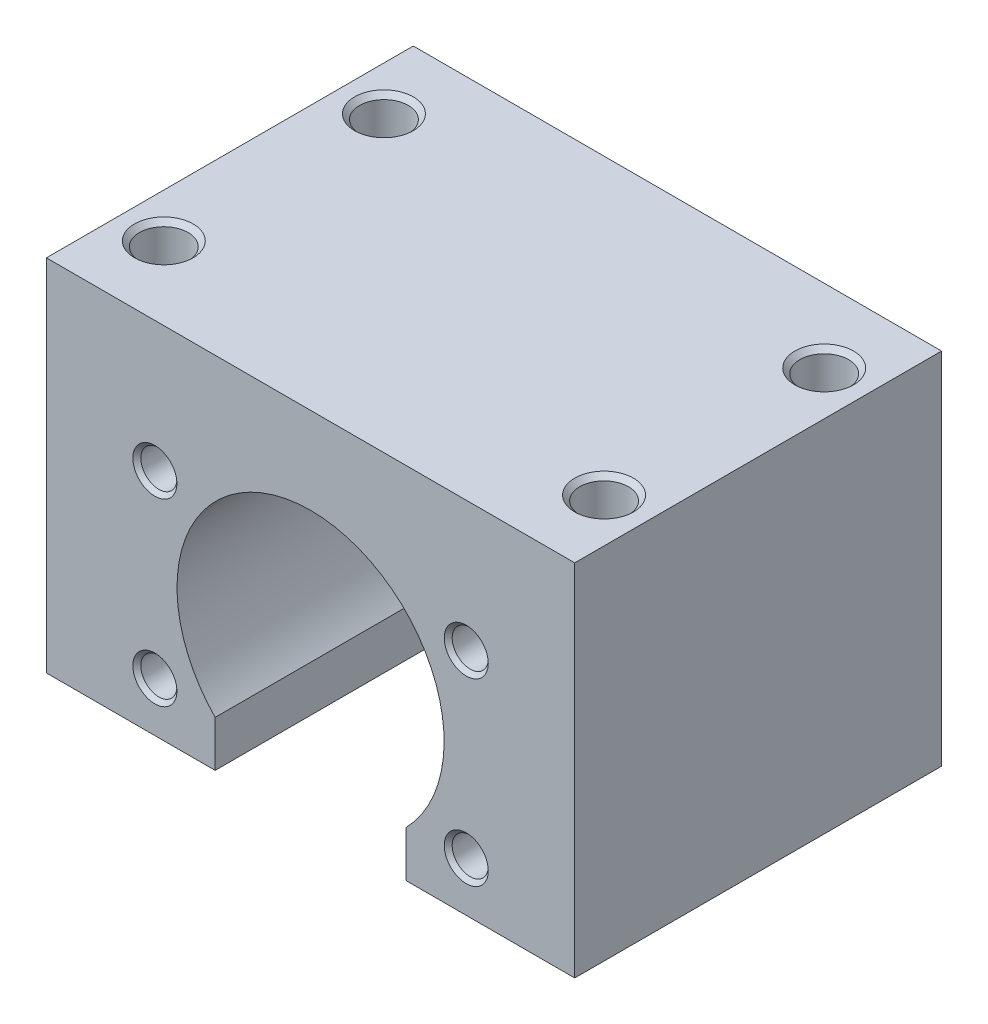
ISO-10303-21;
HEADER;
FILE_DESCRIPTION(('STEP AP214'),'2;1');
FILE_NAME('part.step','',(''),(''),'','','');
FILE_SCHEMA(('AUTOMOTIVE_DESIGN { 1 0 10303 214 1 1 1 1 }'));
ENDSEC;
DATA;
#1=APPLICATION_CONTEXT('core data for automotive mechanical design processes');
#2=APPLICATION_PROTOCOL_DEFINITION('international standard','automotive_design',2000,#1);
#3=PRODUCT_CONTEXT('',#1,'mechanical');
#4=PRODUCT('Part','Part','',(#3));
#5=PRODUCT_RELATED_PRODUCT_CATEGORY('part','',(#4));
#6=PRODUCT_DEFINITION_FORMATION('','',#4);
#7=PRODUCT_DEFINITION_CONTEXT('part definition',#1,'design');
#8=PRODUCT_DEFINITION('design','',#6,#7);
#9=PRODUCT_DEFINITION_SHAPE('','',#8);
#10=(LENGTH_UNIT() NAMED_UNIT(*) SI_UNIT(.MILLI.,.METRE.));
#11=(NAMED_UNIT(*) PLANE_ANGLE_UNIT() SI_UNIT($,.RADIAN.));
#12=(NAMED_UNIT(*) SI_UNIT($,.STERADIAN.) SOLID_ANGLE_UNIT());
#13=UNCERTAINTY_MEASURE_WITH_UNIT(LENGTH_MEASURE(1.E-05),#10,'distance_accuracy_value','');
#14=(GEOMETRIC_REPRESENTATION_CONTEXT(3) GLOBAL_UNCERTAINTY_ASSIGNED_CONTEXT((#13)) GLOBAL_UNIT_ASSIGNED_CONTEXT((#10,
#11,#12)) REPRESENTATION_CONTEXT('',''));
#15=CARTESIAN_POINT('',(0.,0.,0.));
#16=DIRECTION('',(0.,0.,1.));
#17=DIRECTION('',(1.,0.,0.));
#18=AXIS2_PLACEMENT_3D('',#15,#16,#17);
#19=CARTESIAN_POINT('',(21.2176223927187,12.25,13.0000000000337));
#20=DIRECTION('',(0.,0.,1.));
#21=DIRECTION('',(0.,-1.,0.));
#22=AXIS2_PLACEMENT_3D('',#19,#20,#21);
#23=CONICAL_SURFACE('',#22,2.45850000009703,1.04719755119452);
#24=CARTESIAN_POINT('',(21.2176223927187,12.25,11.5805843631733));
#25=VERTEX_POINT('',#24);
#26=VERTEX_LOOP('',#25);
#27=FACE_BOUND('',#26,.T.);
#28=CARTESIAN_POINT('',(21.2176223927187,12.25,13.));
#29=DIRECTION('',(0.,0.,-1.));
#30=DIRECTION('',(-1.,0.,0.));
#31=AXIS2_PLACEMENT_3D('',#28,#29,#30);
#32=CIRCLE('',#31,2.4585);
#33=CARTESIAN_POINT('',(18.7591223927187,12.25,13.));
#34=VERTEX_POINT('',#33);
#35=EDGE_CURVE('E235',#34,#34,#32,.F.);
#36=ORIENTED_EDGE('',*,*,#35,.T.);
#37=EDGE_LOOP('',(#36));
#38=FACE_BOUND('',#37,.T.);
#39=ADVANCED_FACE('F15',(#27,#38),#23,.F.);
#40=CARTESIAN_POINT('',(-21.2176223927187,-12.25,12.9999999999768));
#41=DIRECTION('',(0.,0.,1.));
#42=DIRECTION('',(1.,0.,0.));
#43=AXIS2_PLACEMENT_3D('',#40,#41,#42);
#44=CONICAL_SURFACE('',#43,2.45850000005472,1.04719755120021);
#45=CARTESIAN_POINT('',(-21.2176223927187,-12.25,11.5805843632302));
#46=VERTEX_POINT('',#45);
#47=VERTEX_LOOP('',#46);
#48=FACE_BOUND('',#47,.T.);
#49=CARTESIAN_POINT('',(-21.2176223927187,-12.25,13.));
#50=DIRECTION('',(0.,0.,-1.));
#51=DIRECTION('',(-1.,0.,0.));
#52=AXIS2_PLACEMENT_3D('',#49,#50,#51);
#53=CIRCLE('',#52,2.4585);
#54=CARTESIAN_POINT('',(-23.6761223927187,-12.25,13.));
#55=VERTEX_POINT('',#54);
#56=EDGE_CURVE('E232',#55,#55,#53,.F.);
#57=ORIENTED_EDGE('',*,*,#56,.T.);
#58=EDGE_LOOP('',(#57));
#59=FACE_BOUND('',#58,.T.);
#60=ADVANCED_FACE('F280',(#48,#59),#44,.F.);
#61=CARTESIAN_POINT('',(21.2176223927187,-12.25,13.0000000000337));
#62=DIRECTION('',(0.,0.,1.));
#63=DIRECTION('',(0.,-1.,0.));
#64=AXIS2_PLACEMENT_3D('',#61,#62,#63);
#65=CONICAL_SURFACE('',#64,2.45850000009703,1.04719755119452);
#66=CARTESIAN_POINT('',(21.2176223927187,-12.25,11.5805843631733));
#67=VERTEX_POINT('',#66);
#68=VERTEX_LOOP('',#67);
#69=FACE_BOUND('',#68,.T.);
#70=CARTESIAN_POINT('',(21.2176223927187,-12.25,13.));
#71=DIRECTION('',(0.,0.,-1.));
#72=DIRECTION('',(-1.,0.,0.));
#73=AXIS2_PLACEMENT_3D('',#70,#71,#72);
#74=CIRCLE('',#73,2.4585);
#75=CARTESIAN_POINT('',(18.7591223927187,-12.25,13.));
#76=VERTEX_POINT('',#75);
#77=EDGE_CURVE('E229',#76,#76,#74,.F.);
#78=ORIENTED_EDGE('',*,*,#77,.T.);
#79=EDGE_LOOP('',(#78));
#80=FACE_BOUND('',#79,.T.);
#81=ADVANCED_FACE('F286',(#69,#80),#65,.F.);
#82=CARTESIAN_POINT('',(-21.2176223927187,12.25,12.9999999999768));
#83=DIRECTION('',(0.,0.,1.));
#84=DIRECTION('',(1.,0.,0.));
#85=AXIS2_PLACEMENT_3D('',#82,#83,#84);
#86=CONICAL_SURFACE('',#85,2.45850000005472,1.04719755120021);
#87=CARTESIAN_POINT('',(-21.2176223927187,12.25,11.5805843632302));
#88=VERTEX_POINT('',#87);
#89=VERTEX_LOOP('',#88);
#90=FACE_BOUND('',#89,.T.);
#91=CARTESIAN_POINT('',(-21.2176223927187,12.25,13.));
#92=DIRECTION('',(0.,0.,-1.));
#93=DIRECTION('',(-1.,0.,0.));
#94=AXIS2_PLACEMENT_3D('',#91,#92,#93);
#95=CIRCLE('',#94,2.4585);
#96=CARTESIAN_POINT('',(-23.6761223927187,12.25,13.));
#97=VERTEX_POINT('',#96);
#98=EDGE_CURVE('E226',#97,#97,#95,.F.);
#99=ORIENTED_EDGE('',*,*,#98,.T.);
#100=EDGE_LOOP('',(#99));
#101=FACE_BOUND('',#100,.T.);
#102=ADVANCED_FACE('F392',(#90,#101),#86,.F.);
#103=CARTESIAN_POINT('',(30.,10.7999999999606,-15.));
#104=DIRECTION('',(0.,1.,0.));
#105=DIRECTION('',(0.,0.,1.));
#106=AXIS2_PLACEMENT_3D('',#103,#104,#105);
#107=CONICAL_SURFACE('',#106,3.32349999995131,1.04719755119275);
#108=CARTESIAN_POINT('',(30.,8.88117638032782,-14.9999999999864));
#109=VERTEX_POINT('',#108);
#110=VERTEX_LOOP('',#109);
#111=FACE_BOUND('',#110,.T.);
#112=CARTESIAN_POINT('',(30.,10.8,-15.));
#113=DIRECTION('',(0.,-1.,0.));
#114=DIRECTION('',(0.,0.,-1.));
#115=AXIS2_PLACEMENT_3D('',#112,#113,#114);
#116=CIRCLE('',#115,3.3235);
#117=CARTESIAN_POINT('',(30.,10.8,-18.3235));
#118=VERTEX_POINT('',#117);
#119=EDGE_CURVE('E223',#118,#118,#116,.F.);
#120=ORIENTED_EDGE('',*,*,#119,.T.);
#121=EDGE_LOOP('',(#120));
#122=FACE_BOUND('',#121,.T.);
#123=ADVANCED_FACE('F388',(#111,#122),#107,.F.);
#124=CARTESIAN_POINT('',(30.,10.7999999999606,15.));
#125=DIRECTION('',(0.,1.,0.));
#126=DIRECTION('',(0.,0.,1.));
#127=AXIS2_PLACEMENT_3D('',#124,#125,#126);
#128=CONICAL_SURFACE('',#127,3.32349999995131,1.04719755119275);
#129=CARTESIAN_POINT('',(30.,8.88117638032782,14.9999999999864));
#130=VERTEX_POINT('',#129);
#131=VERTEX_LOOP('',#130);
#132=FACE_BOUND('',#131,.T.);
#133=CARTESIAN_POINT('',(30.,10.8,15.));
#134=DIRECTION('',(0.,1.,0.));
#135=DIRECTION('',(0.,0.,1.));
#136=AXIS2_PLACEMENT_3D('',#133,#134,#135);
#137=CIRCLE('',#136,3.3235);
#138=CARTESIAN_POINT('',(30.,10.8,18.3235));
#139=VERTEX_POINT('',#138);
#140=EDGE_CURVE('E220',#139,#139,#137,.T.);
#141=ORIENTED_EDGE('',*,*,#140,.T.);
#142=EDGE_LOOP('',(#141));
#143=FACE_BOUND('',#142,.T.);
#144=ADVANCED_FACE('F384',(#132,#143),#128,.F.);
#145=CARTESIAN_POINT('',(-30.,10.7999999999606,-15.));
#146=DIRECTION('',(0.,1.,0.));
#147=DIRECTION('',(0.,0.,1.));
#148=AXIS2_PLACEMENT_3D('',#145,#146,#147);
#149=CONICAL_SURFACE('',#148,3.32349999995131,1.04719755119275);
#150=CARTESIAN_POINT('',(-30.,8.88117638032782,-14.9999999999864));
#151=VERTEX_POINT('',#150);
#152=VERTEX_LOOP('',#151);
#153=FACE_BOUND('',#152,.T.);
#154=CARTESIAN_POINT('',(-30.,10.8,-15.));
#155=DIRECTION('',(0.,-1.,0.));
#156=DIRECTION('',(0.,0.,-1.));
#157=AXIS2_PLACEMENT_3D('',#154,#155,#156);
#158=CIRCLE('',#157,3.3235);
#159=CARTESIAN_POINT('',(-30.,10.8,-18.3235));
#160=VERTEX_POINT('',#159);
#161=EDGE_CURVE('E217',#160,#160,#158,.F.);
#162=ORIENTED_EDGE('',*,*,#161,.T.);
#163=EDGE_LOOP('',(#162));
#164=FACE_BOUND('',#163,.T.);
#165=ADVANCED_FACE('F380',(#153,#164),#149,.F.);
#166=CARTESIAN_POINT('',(-30.,10.7999999999606,15.));
#167=DIRECTION('',(0.,1.,0.));
#168=DIRECTION('',(0.,0.,1.));
#169=AXIS2_PLACEMENT_3D('',#166,#167,#168);
#170=CONICAL_SURFACE('',#169,3.32349999995131,1.04719755119275);
#171=CARTESIAN_POINT('',(-30.,8.88117638032782,14.9999999999864));
#172=VERTEX_POINT('',#171);
#173=VERTEX_LOOP('',#172);
#174=FACE_BOUND('',#173,.T.);
#175=CARTESIAN_POINT('',(-30.,10.8,15.));
#176=DIRECTION('',(0.,1.,0.));
#177=DIRECTION('',(0.,0.,1.));
#178=AXIS2_PLACEMENT_3D('',#175,#176,#177);
#179=CIRCLE('',#178,3.3235);
#180=CARTESIAN_POINT('',(-30.,10.8,18.3235));
#181=VERTEX_POINT('',#180);
#182=EDGE_CURVE('E214',#181,#181,#179,.T.);
#183=ORIENTED_EDGE('',*,*,#182,.T.);
#184=EDGE_LOOP('',(#183));
#185=FACE_BOUND('',#184,.T.);
#186=ADVANCED_FACE('F275',(#174,#185),#170,.F.);
#187=CARTESIAN_POINT('',(21.2176223927187,12.25,18.72925));
#188=DIRECTION('',(0.,0.,-1.));
#189=DIRECTION('',(-1.,0.,0.));
#190=AXIS2_PLACEMENT_3D('',#187,#188,#189);
#191=CYLINDRICAL_SURFACE('',#190,2.4585);
#192=CARTESIAN_POINT('',(21.2176223927187,12.25,24.4584999999802));
#193=DIRECTION('',(0.,0.,1.));
#194=DIRECTION('',(-0.86602540378174,-0.500000000004675,0.));
#195=AXIS2_PLACEMENT_3D('',#192,#193,#194);
#196=CIRCLE('',#195,2.45850000003359);
#197=CARTESIAN_POINT('',(19.0884989374922,11.0207499999717,24.4584999999802));
#198=VERTEX_POINT('',#197);
#199=EDGE_CURVE('E211',#198,#198,#196,.T.);
#200=ORIENTED_EDGE('',*,*,#199,.T.);
#201=EDGE_LOOP('',(#200));
#202=FACE_BOUND('',#201,.T.);
#203=ORIENTED_EDGE('',*,*,#35,.F.);
#204=EDGE_LOOP('',(#203));
#205=FACE_BOUND('',#204,.T.);
#206=ADVANCED_FACE('F271',(#202,#205),#191,.F.);
#207=CARTESIAN_POINT('',(-21.2176223927187,-12.25,18.72925));
#208=DIRECTION('',(0.,0.,-1.));
#209=DIRECTION('',(-1.,0.,0.));
#210=AXIS2_PLACEMENT_3D('',#207,#208,#209);
#211=CYLINDRICAL_SURFACE('',#210,2.4585);
#212=CARTESIAN_POINT('',(-21.2176223927187,-12.25,24.458500000037));
#213=DIRECTION('',(0.,0.,1.));
#214=DIRECTION('',(-0.866025403785115,-0.499999999998829,0.));
#215=AXIS2_PLACEMENT_3D('',#212,#213,#214);
#216=CIRCLE('',#215,2.4585000000405);
#217=CARTESIAN_POINT('',(-23.3467458479595,-13.4792500000174,24.458500000037));
#218=VERTEX_POINT('',#217);
#219=EDGE_CURVE('E208',#218,#218,#216,.T.);
#220=ORIENTED_EDGE('',*,*,#219,.T.);
#221=EDGE_LOOP('',(#220));
#222=FACE_BOUND('',#221,.T.);
#223=ORIENTED_EDGE('',*,*,#56,.F.);
#224=EDGE_LOOP('',(#223));
#225=FACE_BOUND('',#224,.T.);
#226=ADVANCED_FACE('F274',(#222,#225),#211,.F.);
#227=CARTESIAN_POINT('',(21.2176223927187,-12.25,18.72925));
#228=DIRECTION('',(0.,0.,-1.));
#229=DIRECTION('',(-1.,0.,0.));
#230=AXIS2_PLACEMENT_3D('',#227,#228,#229);
#231=CYLINDRICAL_SURFACE('',#230,2.4585);
#232=CARTESIAN_POINT('',(21.2176223927187,-12.25,24.4584999999802));
#233=DIRECTION('',(0.,0.,1.));
#234=DIRECTION('',(-0.86602540378174,0.500000000004675,0.));
#235=AXIS2_PLACEMENT_3D('',#232,#233,#234);
#236=CIRCLE('',#235,2.45850000003359);
#237=CARTESIAN_POINT('',(19.0884989374922,-11.0207499999717,24.4584999999802));
#238=VERTEX_POINT('',#237);
#239=EDGE_CURVE('E205',#238,#238,#236,.T.);
#240=ORIENTED_EDGE('',*,*,#239,.T.);
#241=EDGE_LOOP('',(#240));
#242=FACE_BOUND('',#241,.T.);
#243=ORIENTED_EDGE('',*,*,#77,.F.);
#244=EDGE_LOOP('',(#243));
#245=FACE_BOUND('',#244,.T.);
#246=ADVANCED_FACE('F370',(#242,#245),#231,.F.);
#247=CARTESIAN_POINT('',(-21.2176223927187,12.25,18.72925));
#248=DIRECTION('',(0.,0.,-1.));
#249=DIRECTION('',(-1.,0.,0.));
#250=AXIS2_PLACEMENT_3D('',#247,#248,#249);
#251=CYLINDRICAL_SURFACE('',#250,2.4585);
#252=CARTESIAN_POINT('',(-21.2176223927187,12.25,24.458500000037));
#253=DIRECTION('',(0.,0.,1.));
#254=DIRECTION('',(-0.866025403785115,0.499999999998829,0.));
#255=AXIS2_PLACEMENT_3D('',#252,#253,#254);
#256=CIRCLE('',#255,2.4585000000405);
#257=CARTESIAN_POINT('',(-23.3467458479595,13.4792500000174,24.458500000037));
#258=VERTEX_POINT('',#257);
#259=EDGE_CURVE('E155',#258,#258,#256,.T.);
#260=ORIENTED_EDGE('',*,*,#259,.T.);
#261=EDGE_LOOP('',(#260));
#262=FACE_BOUND('',#261,.T.);
#263=ORIENTED_EDGE('',*,*,#98,.F.);
#264=EDGE_LOOP('',(#263));
#265=FACE_BOUND('',#264,.T.);
#266=ADVANCED_FACE('F366',(#262,#265),#251,.F.);
#267=CARTESIAN_POINT('',(30.,20.06175,-15.));
#268=DIRECTION('',(0.,-1.,0.));
#269=DIRECTION('',(0.,0.,-1.));
#270=AXIS2_PLACEMENT_3D('',#267,#268,#269);
#271=CYLINDRICAL_SURFACE('',#270,3.3235);
#272=CARTESIAN_POINT('',(30.,29.3235000000323,-15.));
#273=DIRECTION('',(0.,1.,0.));
#274=DIRECTION('',(0.,0.,-1.));
#275=AXIS2_PLACEMENT_3D('',#272,#273,#274);
#276=CIRCLE('',#275,3.32350000000815);
#277=CARTESIAN_POINT('',(30.,29.3235000000323,-18.3235000000082));
#278=VERTEX_POINT('',#277);
#279=EDGE_CURVE('E151',#278,#278,#276,.T.);
#280=ORIENTED_EDGE('',*,*,#279,.T.);
#281=EDGE_LOOP('',(#280));
#282=FACE_BOUND('',#281,.T.);
#283=ORIENTED_EDGE('',*,*,#119,.F.);
#284=EDGE_LOOP('',(#283));
#285=FACE_BOUND('',#284,.T.);
#286=ADVANCED_FACE('F362',(#282,#285),#271,.F.);
#287=CARTESIAN_POINT('',(30.,20.06175,15.));
#288=DIRECTION('',(0.,1.,0.));
#289=DIRECTION('',(0.,0.,1.));
#290=AXIS2_PLACEMENT_3D('',#287,#288,#289);
#291=CYLINDRICAL_SURFACE('',#290,3.3235);
#292=CARTESIAN_POINT('',(30.,29.3235000000323,15.));
#293=DIRECTION('',(0.,1.,0.));
#294=DIRECTION('',(0.,0.,1.));
#295=AXIS2_PLACEMENT_3D('',#292,#293,#294);
#296=CIRCLE('',#295,3.32350000000815);
#297=CARTESIAN_POINT('',(30.,29.3235000000323,18.3235000000082));
#298=VERTEX_POINT('',#297);
#299=EDGE_CURVE('E198',#298,#298,#296,.T.);
#300=ORIENTED_EDGE('',*,*,#299,.T.);
#301=EDGE_LOOP('',(#300));
#302=FACE_BOUND('',#301,.T.);
#303=ORIENTED_EDGE('',*,*,#140,.F.);
#304=EDGE_LOOP('',(#303));
#305=FACE_BOUND('',#304,.T.);
#306=ADVANCED_FACE('F358',(#302,#305),#291,.F.);
#307=CARTESIAN_POINT('',(-30.,20.06175,-15.));
#308=DIRECTION('',(0.,-1.,0.));
#309=DIRECTION('',(0.,0.,-1.));
#310=AXIS2_PLACEMENT_3D('',#307,#308,#309);
#311=CYLINDRICAL_SURFACE('',#310,3.3235);
#312=CARTESIAN_POINT('',(-30.,29.3235000000323,-15.));
#313=DIRECTION('',(0.,1.,0.));
#314=DIRECTION('',(0.,0.,-1.));
#315=AXIS2_PLACEMENT_3D('',#312,#313,#314);
#316=CIRCLE('',#315,3.32350000000815);
#317=CARTESIAN_POINT('',(-30.,29.3235000000323,-18.3235000000082));
#318=VERTEX_POINT('',#317);
#319=EDGE_CURVE('E195',#318,#318,#316,.T.);
#320=ORIENTED_EDGE('',*,*,#319,.T.);
#321=EDGE_LOOP('',(#320));
#322=FACE_BOUND('',#321,.T.);
#323=ORIENTED_EDGE('',*,*,#161,.F.);
#324=EDGE_LOOP('',(#323));
#325=FACE_BOUND('',#324,.T.);
#326=ADVANCED_FACE('F354',(#322,#325),#311,.F.);
#327=CARTESIAN_POINT('',(-30.,20.06175,15.));
#328=DIRECTION('',(0.,1.,0.));
#329=DIRECTION('',(0.,0.,1.));
#330=AXIS2_PLACEMENT_3D('',#327,#328,#329);
#331=CYLINDRICAL_SURFACE('',#330,3.3235);
#332=CARTESIAN_POINT('',(-30.,29.3235000000323,15.));
#333=DIRECTION('',(0.,1.,0.));
#334=DIRECTION('',(0.,0.,1.));
#335=AXIS2_PLACEMENT_3D('',#332,#333,#334);
#336=CIRCLE('',#335,3.32350000000815);
#337=CARTESIAN_POINT('',(-30.,29.3235000000323,18.3235000000082));
#338=VERTEX_POINT('',#337);
#339=EDGE_CURVE('E110',#338,#338,#336,.T.);
#340=ORIENTED_EDGE('',*,*,#339,.T.);
#341=EDGE_LOOP('',(#340));
#342=FACE_BOUND('',#341,.T.);
#343=ORIENTED_EDGE('',*,*,#182,.F.);
#344=EDGE_LOOP('',(#343));
#345=FACE_BOUND('',#344,.T.);
#346=ADVANCED_FACE('F267',(#342,#345),#331,.F.);
#347=CARTESIAN_POINT('',(21.2176223927187,12.25,24.9999999999204));
#348=DIRECTION('',(0.,0.,1.));
#349=DIRECTION('',(1.,0.,0.));
#350=AXIS2_PLACEMENT_3D('',#347,#348,#349);
#351=CONICAL_SURFACE('',#350,2.99999999995861,0.785398163389481);
#352=CARTESIAN_POINT('',(21.2176223927187,12.25,25.0000000000341));
#353=DIRECTION('',(0.,0.,1.));
#354=DIRECTION('',(1.,0.,0.));
#355=AXIS2_PLACEMENT_3D('',#352,#353,#354);
#356=CIRCLE('',#355,3.00000000007229);
#357=CARTESIAN_POINT('',(24.217622392791,12.25,25.0000000000341));
#358=VERTEX_POINT('',#357);
#359=EDGE_CURVE('E167',#358,#358,#356,.F.);
#360=ORIENTED_EDGE('',*,*,#359,.F.);
#361=EDGE_LOOP('',(#360));
#362=FACE_BOUND('',#361,.T.);
#363=ORIENTED_EDGE('',*,*,#199,.F.);
#364=EDGE_LOOP('',(#363));
#365=FACE_BOUND('',#364,.T.);
#366=ADVANCED_FACE('F263',(#362,#365),#351,.F.);
#367=CARTESIAN_POINT('',(-21.2176223927187,-12.25,24.9999999999773));
#368=DIRECTION('',(0.,0.,1.));
#369=DIRECTION('',(1.,0.,0.));
#370=AXIS2_PLACEMENT_3D('',#367,#368,#369);
#371=CONICAL_SURFACE('',#370,2.99999999996552,0.785398163383392);
#372=CARTESIAN_POINT('',(-21.2176223927187,-12.25,24.9999999999773));
#373=DIRECTION('',(0.,0.,1.));
#374=DIRECTION('',(1.,0.,0.));
#375=AXIS2_PLACEMENT_3D('',#372,#373,#374);
#376=CIRCLE('',#375,2.99999999996552);
#377=CARTESIAN_POINT('',(-18.2176223927532,-12.25,24.9999999999773));
#378=VERTEX_POINT('',#377);
#379=EDGE_CURVE('E256',#378,#378,#376,.F.);
#380=ORIENTED_EDGE('',*,*,#379,.F.);
#381=EDGE_LOOP('',(#380));
#382=FACE_BOUND('',#381,.T.);
#383=ORIENTED_EDGE('',*,*,#219,.F.);
#384=EDGE_LOOP('',(#383));
#385=FACE_BOUND('',#384,.T.);
#386=ADVANCED_FACE('F266',(#382,#385),#371,.F.);
#387=CARTESIAN_POINT('',(21.2176223927187,-12.25,24.9999999999204));
#388=DIRECTION('',(0.,0.,1.));
#389=DIRECTION('',(1.,0.,0.));
#390=AXIS2_PLACEMENT_3D('',#387,#388,#389);
#391=CONICAL_SURFACE('',#390,2.99999999995861,0.785398163389481);
#392=CARTESIAN_POINT('',(21.2176223927187,-12.25,25.0000000000341));
#393=DIRECTION('',(0.,0.,1.));
#394=DIRECTION('',(1.,0.,0.));
#395=AXIS2_PLACEMENT_3D('',#392,#393,#394);
#396=CIRCLE('',#395,3.00000000007229);
#397=CARTESIAN_POINT('',(24.217622392791,-12.25,25.0000000000341));
#398=VERTEX_POINT('',#397);
#399=EDGE_CURVE('E253',#398,#398,#396,.F.);
#400=ORIENTED_EDGE('',*,*,#399,.F.);
#401=EDGE_LOOP('',(#400));
#402=FACE_BOUND('',#401,.T.);
#403=ORIENTED_EDGE('',*,*,#239,.F.);
#404=EDGE_LOOP('',(#403));
#405=FACE_BOUND('',#404,.T.);
#406=ADVANCED_FACE('F344',(#402,#405),#391,.F.);
#407=CARTESIAN_POINT('',(-21.2176223927187,12.25,24.9999999999773));
#408=DIRECTION('',(0.,0.,1.));
#409=DIRECTION('',(1.,0.,0.));
#410=AXIS2_PLACEMENT_3D('',#407,#408,#409);
#411=CONICAL_SURFACE('',#410,2.99999999996552,0.785398163383392);
#412=CARTESIAN_POINT('',(-21.2176223927187,12.25,24.9999999999773));
#413=DIRECTION('',(0.,0.,1.));
#414=DIRECTION('',(1.,0.,0.));
#415=AXIS2_PLACEMENT_3D('',#412,#413,#414);
#416=CIRCLE('',#415,2.99999999996552);
#417=CARTESIAN_POINT('',(-18.2176223927532,12.25,24.9999999999773));
#418=VERTEX_POINT('',#417);
#419=EDGE_CURVE('E162',#418,#418,#416,.F.);
#420=ORIENTED_EDGE('',*,*,#419,.F.);
#421=EDGE_LOOP('',(#420));
#422=FACE_BOUND('',#421,.T.);
#423=ORIENTED_EDGE('',*,*,#259,.F.);
#424=EDGE_LOOP('',(#423));
#425=FACE_BOUND('',#424,.T.);
#426=ADVANCED_FACE('F340',(#422,#425),#411,.F.);
#427=CARTESIAN_POINT('',(-36.,-19.,25.));
#428=DIRECTION('',(0.,-1.,0.));
#429=DIRECTION('',(0.,0.,-1.));
#430=AXIS2_PLACEMENT_3D('',#427,#428,#429);
#431=PLANE('',#430);
#432=DIRECTION('',(1.,0.,0.));
#433=VECTOR('',#432,1.);
#434=CARTESIAN_POINT('',(0.,-19.,25.));
#435=LINE('',#434,#433);
#436=CARTESIAN_POINT('',(-36.,-19.,25.));
#437=VERTEX_POINT('',#436);
#438=CARTESIAN_POINT('',(-13.,-19.,25.));
#439=VERTEX_POINT('',#438);
#440=EDGE_CURVE('E158',#437,#439,#435,.T.);
#441=ORIENTED_EDGE('',*,*,#440,.F.);
#442=DIRECTION('',(0.,0.,1.));
#443=VECTOR('',#442,1.);
#444=CARTESIAN_POINT('',(-36.,-19.,25.));
#445=LINE('',#444,#443);
#446=CARTESIAN_POINT('',(-36.,-19.,-25.));
#447=VERTEX_POINT('',#446);
#448=EDGE_CURVE('E128',#447,#437,#445,.T.);
#449=ORIENTED_EDGE('',*,*,#448,.F.);
#450=DIRECTION('',(1.,0.,0.));
#451=VECTOR('',#450,1.);
#452=CARTESIAN_POINT('',(0.,-19.,-25.));
#453=LINE('',#452,#451);
#454=CARTESIAN_POINT('',(-13.,-19.,-25.));
#455=VERTEX_POINT('',#454);
#456=EDGE_CURVE('E125',#447,#455,#453,.T.);
#457=ORIENTED_EDGE('',*,*,#456,.T.);
#458=DIRECTION('',(0.,0.,-1.));
#459=VECTOR('',#458,1.);
#460=CARTESIAN_POINT('',(-13.,-19.,25.));
#461=LINE('',#460,#459);
#462=EDGE_CURVE('E120',#439,#455,#461,.T.);
#463=ORIENTED_EDGE('',*,*,#462,.F.);
#464=EDGE_LOOP('',(#441,#449,#457,#463));
#465=FACE_BOUND('',#464,.T.);
#466=ADVANCED_FACE('F337',(#465),#431,.T.);
#467=CARTESIAN_POINT('',(-13.,-19.,25.));
#468=DIRECTION('',(1.,0.,0.));
#469=DIRECTION('',(0.,0.,-1.));
#470=AXIS2_PLACEMENT_3D('',#467,#468,#469);
#471=PLANE('',#470);
#472=DIRECTION('',(0.,1.,0.));
#473=VECTOR('',#472,1.);
#474=CARTESIAN_POINT('',(-13.,0.,25.));
#475=LINE('',#474,#473);
#476=CARTESIAN_POINT('',(-13.,-12.7373466624725,25.));
#477=VERTEX_POINT('',#476);
#478=EDGE_CURVE('E161',#439,#477,#475,.T.);
#479=ORIENTED_EDGE('',*,*,#478,.F.);
#480=ORIENTED_EDGE('',*,*,#462,.T.);
#481=DIRECTION('',(0.,1.,0.));
#482=VECTOR('',#481,1.);
#483=CARTESIAN_POINT('',(-13.,0.,-25.));
#484=LINE('',#483,#482);
#485=CARTESIAN_POINT('',(-13.,-12.7373466624725,-25.));
#486=VERTEX_POINT('',#485);
#487=EDGE_CURVE('E107',#455,#486,#484,.T.);
#488=ORIENTED_EDGE('',*,*,#487,.T.);
#489=DIRECTION('',(0.,0.,1.));
#490=VECTOR('',#489,1.);
#491=CARTESIAN_POINT('',(-13.,-12.7373466624725,25.));
#492=LINE('',#491,#490);
#493=EDGE_CURVE('E112',#486,#477,#492,.T.);
#494=ORIENTED_EDGE('',*,*,#493,.T.);
#495=EDGE_LOOP('',(#479,#480,#488,#494));
#496=FACE_BOUND('',#495,.T.);
#497=ADVANCED_FACE('F123',(#496),#471,.T.);
#498=CARTESIAN_POINT('',(0.,0.,25.));
#499=DIRECTION('',(0.,0.,1.));
#500=DIRECTION('',(1.,0.,0.));
#501=AXIS2_PLACEMENT_3D('',#498,#499,#500);
#502=CYLINDRICAL_SURFACE('',#501,18.2);
#503=CARTESIAN_POINT('',(0.,0.,-25.));
#504=DIRECTION('',(0.,0.,1.));
#505=DIRECTION('',(1.,0.,0.));
#506=AXIS2_PLACEMENT_3D('',#503,#504,#505);
#507=CIRCLE('',#506,18.2);
#508=CARTESIAN_POINT('',(13.,-12.7373466624725,-25.));
#509=VERTEX_POINT('',#508);
#510=EDGE_CURVE('E18',#486,#509,#507,.F.);
#511=ORIENTED_EDGE('',*,*,#510,.T.);
#512=DIRECTION('',(0.,0.,1.));
#513=VECTOR('',#512,1.);
#514=CARTESIAN_POINT('',(13.,-12.7373466624725,25.));
#515=LINE('',#514,#513);
#516=CARTESIAN_POINT('',(13.,-12.7373466624725,25.));
#517=VERTEX_POINT('',#516);
#518=EDGE_CURVE('E119',#517,#509,#515,.F.);
#519=ORIENTED_EDGE('',*,*,#518,.F.);
#520=CARTESIAN_POINT('',(0.,0.,25.));
#521=DIRECTION('',(0.,0.,1.));
#522=DIRECTION('',(1.,0.,0.));
#523=AXIS2_PLACEMENT_3D('',#520,#521,#522);
#524=CIRCLE('',#523,18.2);
#525=EDGE_CURVE('E115',#477,#517,#524,.F.);
#526=ORIENTED_EDGE('',*,*,#525,.F.);
#527=ORIENTED_EDGE('',*,*,#493,.F.);
#528=EDGE_LOOP('',(#511,#519,#526,#527));
#529=FACE_BOUND('',#528,.T.);
#530=ADVANCED_FACE('F113',(#529),#502,.F.);
#531=CARTESIAN_POINT('',(13.,-12.7373466624725,25.));
#532=DIRECTION('',(-1.,0.,0.));
#533=DIRECTION('',(0.,0.,1.));
#534=AXIS2_PLACEMENT_3D('',#531,#532,#533);
#535=PLANE('',#534);
#536=DIRECTION('',(0.,1.,0.));
#537=VECTOR('',#536,1.);
#538=CARTESIAN_POINT('',(13.,0.,25.));
#539=LINE('',#538,#537);
#540=CARTESIAN_POINT('',(13.,-19.,25.));
#541=VERTEX_POINT('',#540);
#542=EDGE_CURVE('E146',#517,#541,#539,.F.);
#543=ORIENTED_EDGE('',*,*,#542,.F.);
#544=ORIENTED_EDGE('',*,*,#518,.T.);
#545=DIRECTION('',(0.,1.,0.));
#546=VECTOR('',#545,1.);
#547=CARTESIAN_POINT('',(13.,0.,-25.));
#548=LINE('',#547,#546);
#549=CARTESIAN_POINT('',(13.,-19.,-25.));
#550=VERTEX_POINT('',#549);
#551=EDGE_CURVE('E109',#509,#550,#548,.F.);
#552=ORIENTED_EDGE('',*,*,#551,.T.);
#553=DIRECTION('',(0.,0.,-1.));
#554=VECTOR('',#553,1.);
#555=CARTESIAN_POINT('',(13.,-19.,25.));
#556=LINE('',#555,#554);
#557=EDGE_CURVE('E142',#541,#550,#556,.T.);
#558=ORIENTED_EDGE('',*,*,#557,.F.);
#559=EDGE_LOOP('',(#543,#544,#552,#558));
#560=FACE_BOUND('',#559,.T.);
#561=ADVANCED_FACE('F328',(#560),#535,.T.);
#562=CARTESIAN_POINT('',(13.,-19.,25.));
#563=DIRECTION('',(0.,-1.,0.));
#564=DIRECTION('',(0.,0.,-1.));
#565=AXIS2_PLACEMENT_3D('',#562,#563,#564);
#566=PLANE('',#565);
#567=DIRECTION('',(1.,0.,0.));
#568=VECTOR('',#567,1.);
#569=CARTESIAN_POINT('',(0.,-19.,25.));
#570=LINE('',#569,#568);
#571=CARTESIAN_POINT('',(36.,-19.,25.));
#572=VERTEX_POINT('',#571);
#573=EDGE_CURVE('E143',#541,#572,#570,.T.);
#574=ORIENTED_EDGE('',*,*,#573,.F.);
#575=ORIENTED_EDGE('',*,*,#557,.T.);
#576=DIRECTION('',(1.,0.,0.));
#577=VECTOR('',#576,1.);
#578=CARTESIAN_POINT('',(0.,-19.,-25.));
#579=LINE('',#578,#577);
#580=CARTESIAN_POINT('',(36.,-19.,-25.));
#581=VERTEX_POINT('',#580);
#582=EDGE_CURVE('E130',#550,#581,#579,.T.);
#583=ORIENTED_EDGE('',*,*,#582,.T.);
#584=DIRECTION('',(0.,0.,-1.));
#585=VECTOR('',#584,1.);
#586=CARTESIAN_POINT('',(36.,-19.,25.));
#587=LINE('',#586,#585);
#588=EDGE_CURVE('E249',#572,#581,#587,.T.);
#589=ORIENTED_EDGE('',*,*,#588,.F.);
#590=EDGE_LOOP('',(#574,#575,#583,#589));
#591=FACE_BOUND('',#590,.T.);
#592=ADVANCED_FACE('F324',(#591),#566,.T.);
#593=CARTESIAN_POINT('',(30.,29.9999999999159,-15.));
#594=DIRECTION('',(0.,1.,0.));
#595=DIRECTION('',(0.,0.,1.));
#596=AXIS2_PLACEMENT_3D('',#593,#594,#595);
#597=CONICAL_SURFACE('',#596,3.99999999989177,0.785398163397448);
#598=CARTESIAN_POINT('',(30.,29.9999999999727,-15.));
#599=DIRECTION('',(0.,1.,0.));
#600=DIRECTION('',(0.,0.,1.));
#601=AXIS2_PLACEMENT_3D('',#598,#599,#600);
#602=CIRCLE('',#601,3.99999999994861);
#603=CARTESIAN_POINT('',(30.,29.9999999999727,-11.0000000000514));
#604=VERTEX_POINT('',#603);
#605=EDGE_CURVE('E246',#604,#604,#602,.F.);
#606=ORIENTED_EDGE('',*,*,#605,.F.);
#607=EDGE_LOOP('',(#606));
#608=FACE_BOUND('',#607,.T.);
#609=ORIENTED_EDGE('',*,*,#279,.F.);
#610=EDGE_LOOP('',(#609));
#611=FACE_BOUND('',#610,.T.);
#612=ADVANCED_FACE('F320',(#608,#611),#597,.F.);
#613=CARTESIAN_POINT('',(30.,29.9999999999159,15.));
#614=DIRECTION('',(0.,1.,0.));
#615=DIRECTION('',(0.,0.,1.));
#616=AXIS2_PLACEMENT_3D('',#613,#614,#615);
#617=CONICAL_SURFACE('',#616,3.99999999989177,0.785398163397448);
#618=CARTESIAN_POINT('',(30.,29.9999999999727,15.));
#619=DIRECTION('',(0.,1.,0.));
#620=DIRECTION('',(0.,0.,1.));
#621=AXIS2_PLACEMENT_3D('',#618,#619,#620);
#622=CIRCLE('',#621,3.99999999994861);
#623=CARTESIAN_POINT('',(30.,29.9999999999727,18.9999999999486));
#624=VERTEX_POINT('',#623);
#625=EDGE_CURVE('E243',#624,#624,#622,.F.);
#626=ORIENTED_EDGE('',*,*,#625,.F.);
#627=EDGE_LOOP('',(#626));
#628=FACE_BOUND('',#627,.T.);
#629=ORIENTED_EDGE('',*,*,#299,.F.);
#630=EDGE_LOOP('',(#629));
#631=FACE_BOUND('',#630,.T.);
#632=ADVANCED_FACE('F316',(#628,#631),#617,.F.);
#633=CARTESIAN_POINT('',(-30.,29.9999999999159,-15.));
#634=DIRECTION('',(0.,1.,0.));
#635=DIRECTION('',(0.,0.,1.));
#636=AXIS2_PLACEMENT_3D('',#633,#634,#635);
#637=CONICAL_SURFACE('',#636,3.99999999989177,0.785398163397448);
#638=CARTESIAN_POINT('',(-30.,29.9999999999727,-15.));
#639=DIRECTION('',(0.,1.,0.));
#640=DIRECTION('',(0.,0.,1.));
#641=AXIS2_PLACEMENT_3D('',#638,#639,#640);
#642=CIRCLE('',#641,3.99999999994861);
#643=CARTESIAN_POINT('',(-30.,29.9999999999727,-11.0000000000514));
#644=VERTEX_POINT('',#643);
#645=EDGE_CURVE('E240',#644,#644,#642,.F.);
#646=ORIENTED_EDGE('',*,*,#645,.F.);
#647=EDGE_LOOP('',(#646));
#648=FACE_BOUND('',#647,.T.);
#649=ORIENTED_EDGE('',*,*,#319,.F.);
#650=EDGE_LOOP('',(#649));
#651=FACE_BOUND('',#650,.T.);
#652=ADVANCED_FACE('F312',(#648,#651),#637,.F.);
#653=CARTESIAN_POINT('',(-30.,29.9999999999159,15.));
#654=DIRECTION('',(0.,1.,0.));
#655=DIRECTION('',(0.,0.,1.));
#656=AXIS2_PLACEMENT_3D('',#653,#654,#655);
#657=CONICAL_SURFACE('',#656,3.99999999989177,0.785398163397448);
#658=CARTESIAN_POINT('',(-30.,29.9999999999727,15.));
#659=DIRECTION('',(0.,1.,0.));
#660=DIRECTION('',(0.,0.,1.));
#661=AXIS2_PLACEMENT_3D('',#658,#659,#660);
#662=CIRCLE('',#661,3.99999999994861);
#663=CARTESIAN_POINT('',(-30.,29.9999999999727,18.9999999999486));
#664=VERTEX_POINT('',#663);
#665=EDGE_CURVE('E187',#664,#664,#662,.F.);
#666=ORIENTED_EDGE('',*,*,#665,.F.);
#667=EDGE_LOOP('',(#666));
#668=FACE_BOUND('',#667,.T.);
#669=ORIENTED_EDGE('',*,*,#339,.F.);
#670=EDGE_LOOP('',(#669));
#671=FACE_BOUND('',#670,.T.);
#672=ADVANCED_FACE('F309',(#668,#671),#657,.F.);
#673=CARTESIAN_POINT('',(0.,0.,-25.));
#674=DIRECTION('',(0.,0.,1.));
#675=DIRECTION('',(1.,0.,0.));
#676=AXIS2_PLACEMENT_3D('',#673,#674,#675);
#677=PLANE('',#676);
#678=ORIENTED_EDGE('',*,*,#456,.F.);
#679=DIRECTION('',(0.,1.,0.));
#680=VECTOR('',#679,1.);
#681=CARTESIAN_POINT('',(-36.,30.,-25.));
#682=LINE('',#681,#680);
#683=CARTESIAN_POINT('',(-36.,30.,-25.));
#684=VERTEX_POINT('',#683);
#685=EDGE_CURVE('E124',#684,#447,#682,.F.);
#686=ORIENTED_EDGE('',*,*,#685,.F.);
#687=DIRECTION('',(1.,0.,0.));
#688=VECTOR('',#687,1.);
#689=CARTESIAN_POINT('',(36.,30.,-25.));
#690=LINE('',#689,#688);
#691=CARTESIAN_POINT('',(36.,30.,-25.));
#692=VERTEX_POINT('',#691);
#693=EDGE_CURVE('E182',#692,#684,#690,.F.);
#694=ORIENTED_EDGE('',*,*,#693,.F.);
#695=DIRECTION('',(0.,1.,0.));
#696=VECTOR('',#695,1.);
#697=CARTESIAN_POINT('',(36.,-19.,-25.));
#698=LINE('',#697,#696);
#699=EDGE_CURVE('E172',#581,#692,#698,.T.);
#700=ORIENTED_EDGE('',*,*,#699,.F.);
#701=ORIENTED_EDGE('',*,*,#582,.F.);
#702=ORIENTED_EDGE('',*,*,#551,.F.);
#703=ORIENTED_EDGE('',*,*,#510,.F.);
#704=ORIENTED_EDGE('',*,*,#487,.F.);
#705=EDGE_LOOP('',(#678,#686,#694,#700,#701,#702,#703,#704));
#706=FACE_BOUND('',#705,.T.);
#707=ADVANCED_FACE('F105',(#706),#677,.F.);
#708=CARTESIAN_POINT('',(-36.,30.,25.));
#709=DIRECTION('',(-1.,0.,0.));
#710=DIRECTION('',(0.,0.,1.));
#711=AXIS2_PLACEMENT_3D('',#708,#709,#710);
#712=PLANE('',#711);
#713=DIRECTION('',(0.,1.,0.));
#714=VECTOR('',#713,1.);
#715=CARTESIAN_POINT('',(-36.,0.,25.));
#716=LINE('',#715,#714);
#717=CARTESIAN_POINT('',(-36.,30.,25.));
#718=VERTEX_POINT('',#717);
#719=EDGE_CURVE('E145',#718,#437,#716,.F.);
#720=ORIENTED_EDGE('',*,*,#719,.F.);
#721=DIRECTION('',(0.,0.,1.));
#722=VECTOR('',#721,1.);
#723=CARTESIAN_POINT('',(-36.,30.,25.));
#724=LINE('',#723,#722);
#725=EDGE_CURVE('E179',#684,#718,#724,.T.);
#726=ORIENTED_EDGE('',*,*,#725,.F.);
#727=ORIENTED_EDGE('',*,*,#685,.T.);
#728=ORIENTED_EDGE('',*,*,#448,.T.);
#729=EDGE_LOOP('',(#720,#726,#727,#728));
#730=FACE_BOUND('',#729,.T.);
#731=ADVANCED_FACE('F303',(#730),#712,.T.);
#732=CARTESIAN_POINT('',(0.,0.,25.));
#733=DIRECTION('',(0.,0.,1.));
#734=DIRECTION('',(1.,0.,0.));
#735=AXIS2_PLACEMENT_3D('',#732,#733,#734);
#736=PLANE('',#735);
#737=DIRECTION('',(1.,0.,0.));
#738=VECTOR('',#737,1.);
#739=CARTESIAN_POINT('',(36.,30.,25.));
#740=LINE('',#739,#738);
#741=CARTESIAN_POINT('',(36.,30.,25.));
#742=VERTEX_POINT('',#741);
#743=EDGE_CURVE('E24',#718,#742,#740,.T.);
#744=ORIENTED_EDGE('',*,*,#743,.F.);
#745=ORIENTED_EDGE('',*,*,#719,.T.);
#746=ORIENTED_EDGE('',*,*,#440,.T.);
#747=ORIENTED_EDGE('',*,*,#478,.T.);
#748=ORIENTED_EDGE('',*,*,#525,.T.);
#749=ORIENTED_EDGE('',*,*,#542,.T.);
#750=ORIENTED_EDGE('',*,*,#573,.T.);
#751=DIRECTION('',(0.,1.,0.));
#752=VECTOR('',#751,1.);
#753=CARTESIAN_POINT('',(36.,-19.,25.));
#754=LINE('',#753,#752);
#755=EDGE_CURVE('E33',#742,#572,#754,.F.);
#756=ORIENTED_EDGE('',*,*,#755,.F.);
#757=EDGE_LOOP('',(#744,#745,#746,#747,#748,#749,#750,#756));
#758=FACE_BOUND('',#757,.T.);
#759=ORIENTED_EDGE('',*,*,#419,.T.);
#760=EDGE_LOOP('',(#759));
#761=FACE_BOUND('',#760,.T.);
#762=ORIENTED_EDGE('',*,*,#399,.T.);
#763=EDGE_LOOP('',(#762));
#764=FACE_BOUND('',#763,.T.);
#765=ORIENTED_EDGE('',*,*,#379,.T.);
#766=EDGE_LOOP('',(#765));
#767=FACE_BOUND('',#766,.T.);
#768=ORIENTED_EDGE('',*,*,#359,.T.);
#769=EDGE_LOOP('',(#768));
#770=FACE_BOUND('',#769,.T.);
#771=ADVANCED_FACE('F261',(#758,#761,#764,#767,#770),#736,.T.);
#772=CARTESIAN_POINT('',(36.,-19.,25.));
#773=DIRECTION('',(1.,0.,0.));
#774=DIRECTION('',(0.,0.,-1.));
#775=AXIS2_PLACEMENT_3D('',#772,#773,#774);
#776=PLANE('',#775);
#777=ORIENTED_EDGE('',*,*,#755,.T.);
#778=ORIENTED_EDGE('',*,*,#588,.T.);
#779=ORIENTED_EDGE('',*,*,#699,.T.);
#780=DIRECTION('',(0.,0.,1.));
#781=VECTOR('',#780,1.);
#782=CARTESIAN_POINT('',(36.,30.,25.));
#783=LINE('',#782,#781);
#784=EDGE_CURVE('E9',#742,#692,#783,.F.);
#785=ORIENTED_EDGE('',*,*,#784,.F.);
#786=EDGE_LOOP('',(#777,#778,#779,#785));
#787=FACE_BOUND('',#786,.T.);
#788=ADVANCED_FACE('F290',(#787),#776,.T.);
#789=CARTESIAN_POINT('',(36.,30.,25.));
#790=DIRECTION('',(0.,1.,0.));
#791=DIRECTION('',(0.,0.,1.));
#792=AXIS2_PLACEMENT_3D('',#789,#790,#791);
#793=PLANE('',#792);
#794=ORIENTED_EDGE('',*,*,#743,.T.);
#795=ORIENTED_EDGE('',*,*,#784,.T.);
#796=ORIENTED_EDGE('',*,*,#693,.T.);
#797=ORIENTED_EDGE('',*,*,#725,.T.);
#798=EDGE_LOOP('',(#794,#795,#796,#797));
#799=FACE_BOUND('',#798,.T.);
#800=ORIENTED_EDGE('',*,*,#665,.T.);
#801=EDGE_LOOP('',(#800));
#802=FACE_BOUND('',#801,.T.);
#803=ORIENTED_EDGE('',*,*,#645,.T.);
#804=EDGE_LOOP('',(#803));
#805=FACE_BOUND('',#804,.T.);
#806=ORIENTED_EDGE('',*,*,#625,.T.);
#807=EDGE_LOOP('',(#806));
#808=FACE_BOUND('',#807,.T.);
#809=ORIENTED_EDGE('',*,*,#605,.T.);
#810=EDGE_LOOP('',(#809));
#811=FACE_BOUND('',#810,.T.);
#812=ADVANCED_FACE('F288',(#799,#802,#805,#808,#811),#793,.T.);
#813=CLOSED_SHELL('',(#39,#60,#81,#102,#123,#144,#165,#186,#206,#226,#246,#266,#286,#306,#326,
#346,#366,#386,#406,#426,#466,#497,#530,#561,#592,#612,#632,#652,#672,#707,#731,#771,#788,#812));
#814=MANIFOLD_SOLID_BREP('B1',#813);
#815=ADVANCED_BREP_SHAPE_REPRESENTATION('',(#18,#814),#14);
#816=SHAPE_DEFINITION_REPRESENTATION(#9,#815);
ENDSEC;
END-ISO-10303-21;
